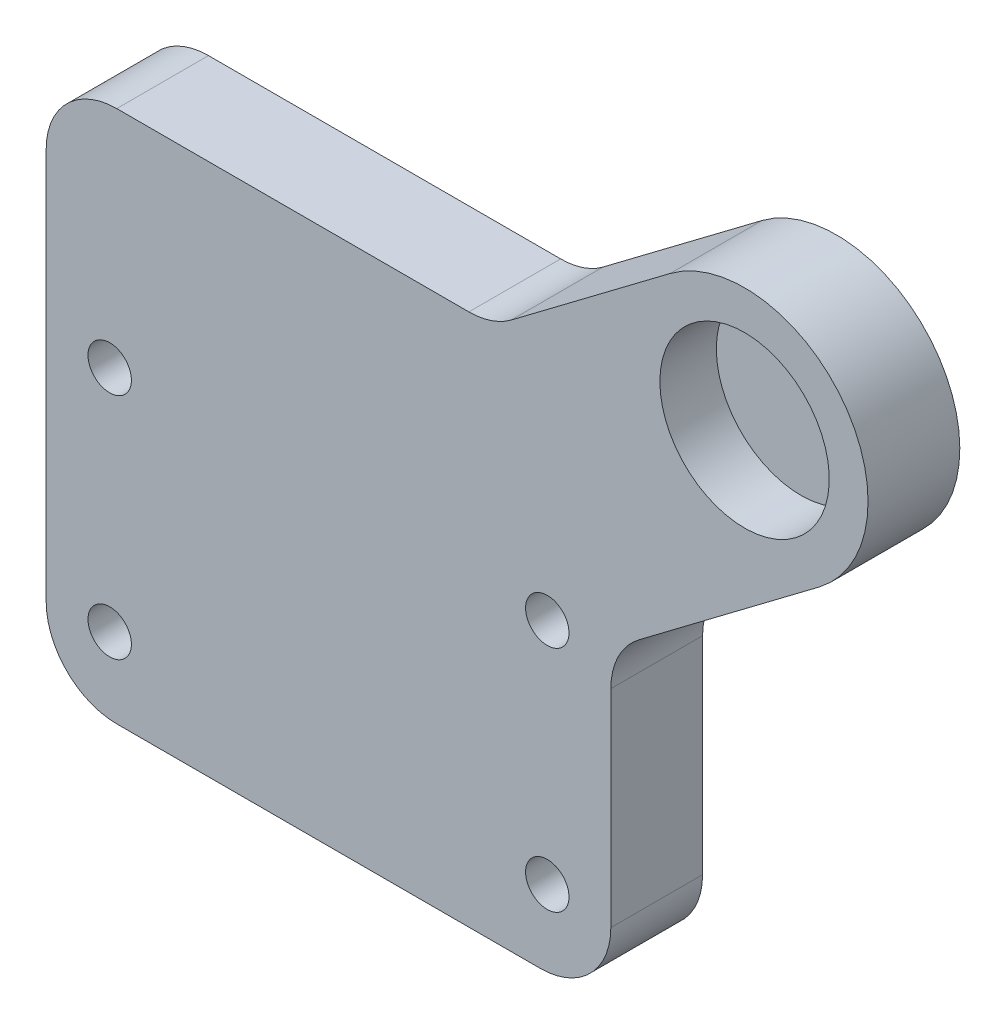
ISO-10303-21;
HEADER;
FILE_DESCRIPTION(('STEP AP214'),'2;1');
FILE_NAME('part.step','',(''),(''),'','','');
FILE_SCHEMA(('AUTOMOTIVE_DESIGN { 1 0 10303 214 1 1 1 1 }'));
ENDSEC;
DATA;
#1=APPLICATION_CONTEXT('core data for automotive mechanical design processes');
#2=APPLICATION_PROTOCOL_DEFINITION('international standard','automotive_design',2000,#1);
#3=PRODUCT_CONTEXT('',#1,'mechanical');
#4=PRODUCT('Part','Part','',(#3));
#5=PRODUCT_RELATED_PRODUCT_CATEGORY('part','',(#4));
#6=PRODUCT_DEFINITION_FORMATION('','',#4);
#7=PRODUCT_DEFINITION_CONTEXT('part definition',#1,'design');
#8=PRODUCT_DEFINITION('design','',#6,#7);
#9=PRODUCT_DEFINITION_SHAPE('','',#8);
#10=(LENGTH_UNIT() NAMED_UNIT(*) SI_UNIT(.MILLI.,.METRE.));
#11=(NAMED_UNIT(*) PLANE_ANGLE_UNIT() SI_UNIT($,.RADIAN.));
#12=(NAMED_UNIT(*) SI_UNIT($,.STERADIAN.) SOLID_ANGLE_UNIT());
#13=UNCERTAINTY_MEASURE_WITH_UNIT(LENGTH_MEASURE(1.E-05),#10,'distance_accuracy_value','');
#14=(GEOMETRIC_REPRESENTATION_CONTEXT(3) GLOBAL_UNCERTAINTY_ASSIGNED_CONTEXT((#13)) GLOBAL_UNIT_ASSIGNED_CONTEXT((#10,
#11,#12)) REPRESENTATION_CONTEXT('',''));
#15=CARTESIAN_POINT('',(0.,0.,0.));
#16=DIRECTION('',(0.,0.,1.));
#17=DIRECTION('',(1.,0.,0.));
#18=AXIS2_PLACEMENT_3D('',#15,#16,#17);
#19=CARTESIAN_POINT('',(58.9473260814253,242.5,18.));
#20=DIRECTION('',(0.,0.,1.));
#21=DIRECTION('',(1.,0.,0.));
#22=AXIS2_PLACEMENT_3D('',#19,#20,#21);
#23=PLANE('',#22);
#24=CARTESIAN_POINT('',(58.9473260814253,242.5,18.));
#25=DIRECTION('',(0.,0.,-1.));
#26=DIRECTION('',(-1.,0.,0.));
#27=AXIS2_PLACEMENT_3D('',#24,#25,#26);
#28=CIRCLE('',#27,12.);
#29=CARTESIAN_POINT('',(46.9473260814253,242.5,18.));
#30=VERTEX_POINT('',#29);
#31=EDGE_CURVE('E19',#30,#30,#28,.F.);
#32=ORIENTED_EDGE('',*,*,#31,.T.);
#33=EDGE_LOOP('',(#32));
#34=FACE_BOUND('',#33,.T.);
#35=ADVANCED_FACE('F16',(#34),#23,.T.);
#36=CARTESIAN_POINT('',(58.9473260814253,242.5,26.));
#37=DIRECTION('',(0.,0.,-1.));
#38=DIRECTION('',(-1.,0.,0.));
#39=AXIS2_PLACEMENT_3D('',#36,#37,#38);
#40=CYLINDRICAL_SURFACE('',#39,12.);
#41=ORIENTED_EDGE('',*,*,#31,.F.);
#42=EDGE_LOOP('',(#41));
#43=FACE_BOUND('',#42,.T.);
#44=CARTESIAN_POINT('',(58.9473260814253,242.5,26.));
#45=DIRECTION('',(0.,0.,-1.));
#46=DIRECTION('',(-1.,0.,0.));
#47=AXIS2_PLACEMENT_3D('',#44,#45,#46);
#48=CIRCLE('',#47,12.);
#49=CARTESIAN_POINT('',(46.9473260814253,242.5,26.));
#50=VERTEX_POINT('',#49);
#51=EDGE_CURVE('E122',#50,#50,#48,.T.);
#52=ORIENTED_EDGE('',*,*,#51,.F.);
#53=EDGE_LOOP('',(#52));
#54=FACE_BOUND('',#53,.T.);
#55=ADVANCED_FACE('F208',(#43,#54),#40,.F.);
#56=CARTESIAN_POINT('',(18.2236630407125,211.,26.));
#57=DIRECTION('',(0.,0.,1.));
#58=DIRECTION('',(1.,0.,0.));
#59=AXIS2_PLACEMENT_3D('',#56,#57,#58);
#60=PLANE('',#59);
#61=CARTESIAN_POINT('',(30.9999999999998,205.2,26.));
#62=DIRECTION('',(0.,0.,-1.));
#63=DIRECTION('',(-1.,0.,0.));
#64=AXIS2_PLACEMENT_3D('',#61,#62,#63);
#65=CIRCLE('',#64,3.075);
#66=CARTESIAN_POINT('',(27.9249999999998,205.2,26.));
#67=VERTEX_POINT('',#66);
#68=EDGE_CURVE('E180',#67,#67,#65,.T.);
#69=ORIENTED_EDGE('',*,*,#68,.T.);
#70=EDGE_LOOP('',(#69));
#71=FACE_BOUND('',#70,.T.);
#72=CARTESIAN_POINT('',(-31.0000000000001,172.8,26.));
#73=DIRECTION('',(0.,0.,-1.));
#74=DIRECTION('',(-1.,0.,0.));
#75=AXIS2_PLACEMENT_3D('',#72,#73,#74);
#76=CIRCLE('',#75,3.075);
#77=CARTESIAN_POINT('',(-34.0750000000001,172.8,26.));
#78=VERTEX_POINT('',#77);
#79=EDGE_CURVE('E183',#78,#78,#76,.T.);
#80=ORIENTED_EDGE('',*,*,#79,.T.);
#81=EDGE_LOOP('',(#80));
#82=FACE_BOUND('',#81,.T.);
#83=CARTESIAN_POINT('',(-31.0000000000002,205.2,26.));
#84=DIRECTION('',(0.,0.,-1.));
#85=DIRECTION('',(-1.,0.,0.));
#86=AXIS2_PLACEMENT_3D('',#83,#84,#85);
#87=CIRCLE('',#86,3.075);
#88=CARTESIAN_POINT('',(-34.0750000000002,205.2,26.));
#89=VERTEX_POINT('',#88);
#90=EDGE_CURVE('E186',#89,#89,#87,.T.);
#91=ORIENTED_EDGE('',*,*,#90,.T.);
#92=EDGE_LOOP('',(#91));
#93=FACE_BOUND('',#92,.T.);
#94=CARTESIAN_POINT('',(30.9999999999999,172.8,26.));
#95=DIRECTION('',(0.,0.,-1.));
#96=DIRECTION('',(-1.,0.,0.));
#97=AXIS2_PLACEMENT_3D('',#94,#95,#96);
#98=CIRCLE('',#97,3.075);
#99=CARTESIAN_POINT('',(27.9249999999999,172.8,26.));
#100=VERTEX_POINT('',#99);
#101=EDGE_CURVE('E189',#100,#100,#98,.T.);
#102=ORIENTED_EDGE('',*,*,#101,.T.);
#103=EDGE_LOOP('',(#102));
#104=FACE_BOUND('',#103,.T.);
#105=ORIENTED_EDGE('',*,*,#51,.T.);
#106=EDGE_LOOP('',(#105));
#107=FACE_BOUND('',#106,.T.);
#108=DIRECTION('',(-0.798635510047293,-0.601815023152049,0.));
#109=VECTOR('',#108,1.);
#110=CARTESIAN_POINT('',(48.4155631762645,256.476121425828,26.));
#111=LINE('',#110,#109);
#112=CARTESIAN_POINT('',(25.9055965401796,239.513644899527,26.));
#113=VERTEX_POINT('',#112);
#114=CARTESIAN_POINT('',(48.4155631762644,256.476121425828,26.));
#115=VERTEX_POINT('',#114);
#116=EDGE_CURVE('E135',#113,#115,#111,.F.);
#117=ORIENTED_EDGE('',*,*,#116,.F.);
#118=CARTESIAN_POINT('',(19.8874463086592,247.5,26.));
#119=DIRECTION('',(0.,0.,1.));
#120=DIRECTION('',(1.,0.,0.));
#121=AXIS2_PLACEMENT_3D('',#118,#119,#120);
#122=CIRCLE('',#121,10.0000000000002);
#123=CARTESIAN_POINT('',(19.8874463086592,237.5,26.));
#124=VERTEX_POINT('',#123);
#125=EDGE_CURVE('E192',#113,#124,#122,.F.);
#126=ORIENTED_EDGE('',*,*,#125,.T.);
#127=DIRECTION('',(1.,0.,0.));
#128=VECTOR('',#127,1.);
#129=CARTESIAN_POINT('',(19.8874463086592,237.5,26.));
#130=LINE('',#129,#128);
#131=CARTESIAN_POINT('',(-30.0000000000002,237.5,26.));
#132=VERTEX_POINT('',#131);
#133=EDGE_CURVE('E118',#132,#124,#130,.T.);
#134=ORIENTED_EDGE('',*,*,#133,.F.);
#135=CARTESIAN_POINT('',(-30.0000000000002,227.5,26.));
#136=DIRECTION('',(0.,0.,1.));
#137=DIRECTION('',(1.,0.,0.));
#138=AXIS2_PLACEMENT_3D('',#135,#136,#137);
#139=CIRCLE('',#138,10.);
#140=CARTESIAN_POINT('',(-40.0000000000002,227.5,26.));
#141=VERTEX_POINT('',#140);
#142=EDGE_CURVE('E112',#141,#132,#139,.F.);
#143=ORIENTED_EDGE('',*,*,#142,.F.);
#144=DIRECTION('',(0.,1.,0.));
#145=VECTOR('',#144,1.);
#146=CARTESIAN_POINT('',(-40.0000000000002,227.5,26.));
#147=LINE('',#146,#145);
#148=CARTESIAN_POINT('',(-40.0000000000002,172.,26.));
#149=VERTEX_POINT('',#148);
#150=EDGE_CURVE('E102',#149,#141,#147,.T.);
#151=ORIENTED_EDGE('',*,*,#150,.F.);
#152=CARTESIAN_POINT('',(-30.0000000000002,172.,26.));
#153=DIRECTION('',(0.,0.,1.));
#154=DIRECTION('',(1.,0.,0.));
#155=AXIS2_PLACEMENT_3D('',#152,#153,#154);
#156=CIRCLE('',#155,10.);
#157=CARTESIAN_POINT('',(-30.0000000000002,162.,26.));
#158=VERTEX_POINT('',#157);
#159=EDGE_CURVE('E127',#158,#149,#156,.F.);
#160=ORIENTED_EDGE('',*,*,#159,.F.);
#161=DIRECTION('',(1.,0.,0.));
#162=VECTOR('',#161,1.);
#163=CARTESIAN_POINT('',(-30.0000000000002,162.,26.));
#164=LINE('',#163,#162);
#165=CARTESIAN_POINT('',(30.0000000000002,162.,26.));
#166=VERTEX_POINT('',#165);
#167=EDGE_CURVE('E147',#166,#158,#164,.F.);
#168=ORIENTED_EDGE('',*,*,#167,.F.);
#169=CARTESIAN_POINT('',(30.0000000000002,172.,26.));
#170=DIRECTION('',(0.,0.,1.));
#171=DIRECTION('',(1.,0.,0.));
#172=AXIS2_PLACEMENT_3D('',#169,#170,#171);
#173=CIRCLE('',#172,10.);
#174=CARTESIAN_POINT('',(40.0000000000002,172.,26.));
#175=VERTEX_POINT('',#174);
#176=EDGE_CURVE('E200',#175,#166,#173,.F.);
#177=ORIENTED_EDGE('',*,*,#176,.F.);
#178=DIRECTION('',(0.,1.,0.));
#179=VECTOR('',#178,1.);
#180=CARTESIAN_POINT('',(40.0000000000002,172.,26.));
#181=LINE('',#180,#179);
#182=CARTESIAN_POINT('',(40.0000000000002,201.323975594456,26.));
#183=VERTEX_POINT('',#182);
#184=EDGE_CURVE('E143',#183,#175,#181,.F.);
#185=ORIENTED_EDGE('',*,*,#184,.F.);
#186=CARTESIAN_POINT('',(50.0000000000002,201.323975594456,26.));
#187=DIRECTION('',(0.,0.,1.));
#188=DIRECTION('',(1.,0.,0.));
#189=AXIS2_PLACEMENT_3D('',#186,#187,#188);
#190=CIRCLE('',#189,9.99999999999997);
#191=CARTESIAN_POINT('',(43.9818497684799,209.310330694928,26.));
#192=VERTEX_POINT('',#191);
#193=EDGE_CURVE('E142',#183,#192,#190,.F.);
#194=ORIENTED_EDGE('',*,*,#193,.T.);
#195=DIRECTION('',(0.798635510047291,0.60181502315205,0.));
#196=VECTOR('',#195,1.);
#197=CARTESIAN_POINT('',(43.9818497684797,209.310330694928,26.));
#198=LINE('',#197,#196);
#199=CARTESIAN_POINT('',(69.4790889865861,228.523878574172,26.));
#200=VERTEX_POINT('',#199);
#201=EDGE_CURVE('E139',#200,#192,#198,.F.);
#202=ORIENTED_EDGE('',*,*,#201,.F.);
#203=CARTESIAN_POINT('',(58.9473260814253,242.5,26.));
#204=DIRECTION('',(0.,0.,1.));
#205=DIRECTION('',(1.,0.,0.));
#206=AXIS2_PLACEMENT_3D('',#203,#204,#205);
#207=CIRCLE('',#206,17.4999999999999);
#208=EDGE_CURVE('E195',#115,#200,#207,.F.);
#209=ORIENTED_EDGE('',*,*,#208,.F.);
#210=EDGE_LOOP('',(#117,#126,#134,#143,#151,#160,#168,#177,#185,#194,#202,#209));
#211=FACE_BOUND('',#210,.T.);
#212=ADVANCED_FACE('F116',(#71,#82,#93,#104,#107,#211),#60,.T.);
#213=CARTESIAN_POINT('',(-30.0000000000002,227.5,13.));
#214=DIRECTION('',(0.,0.,1.));
#215=DIRECTION('',(1.,0.,0.));
#216=AXIS2_PLACEMENT_3D('',#213,#214,#215);
#217=CYLINDRICAL_SURFACE('',#216,10.);
#218=ORIENTED_EDGE('',*,*,#142,.T.);
#219=DIRECTION('',(0.,0.,1.));
#220=VECTOR('',#219,1.);
#221=CARTESIAN_POINT('',(-30.0000000000002,237.5,13.));
#222=LINE('',#221,#220);
#223=CARTESIAN_POINT('',(-30.0000000000002,237.5,13.));
#224=VERTEX_POINT('',#223);
#225=EDGE_CURVE('E134',#224,#132,#222,.T.);
#226=ORIENTED_EDGE('',*,*,#225,.F.);
#227=CARTESIAN_POINT('',(-30.0000000000002,227.5,13.));
#228=DIRECTION('',(0.,0.,1.));
#229=DIRECTION('',(1.,0.,0.));
#230=AXIS2_PLACEMENT_3D('',#227,#228,#229);
#231=CIRCLE('',#230,10.);
#232=CARTESIAN_POINT('',(-40.0000000000002,227.5,13.));
#233=VERTEX_POINT('',#232);
#234=EDGE_CURVE('E126',#224,#233,#231,.T.);
#235=ORIENTED_EDGE('',*,*,#234,.T.);
#236=DIRECTION('',(0.,0.,1.));
#237=VECTOR('',#236,1.);
#238=CARTESIAN_POINT('',(-40.0000000000002,227.5,13.));
#239=LINE('',#238,#237);
#240=EDGE_CURVE('E107',#141,#233,#239,.F.);
#241=ORIENTED_EDGE('',*,*,#240,.F.);
#242=EDGE_LOOP('',(#218,#226,#235,#241));
#243=FACE_BOUND('',#242,.T.);
#244=ADVANCED_FACE('F125',(#243),#217,.T.);
#245=CARTESIAN_POINT('',(-40.0000000000002,227.5,13.));
#246=DIRECTION('',(-1.,0.,0.));
#247=DIRECTION('',(0.,0.,1.));
#248=AXIS2_PLACEMENT_3D('',#245,#246,#247);
#249=PLANE('',#248);
#250=ORIENTED_EDGE('',*,*,#150,.T.);
#251=ORIENTED_EDGE('',*,*,#240,.T.);
#252=DIRECTION('',(0.,1.,0.));
#253=VECTOR('',#252,1.);
#254=CARTESIAN_POINT('',(-40.0000000000002,211.,13.));
#255=LINE('',#254,#253);
#256=CARTESIAN_POINT('',(-40.0000000000002,172.,13.));
#257=VERTEX_POINT('',#256);
#258=EDGE_CURVE('E178',#233,#257,#255,.F.);
#259=ORIENTED_EDGE('',*,*,#258,.T.);
#260=DIRECTION('',(0.,0.,1.));
#261=VECTOR('',#260,1.);
#262=CARTESIAN_POINT('',(-40.0000000000002,172.,13.));
#263=LINE('',#262,#261);
#264=EDGE_CURVE('E109',#149,#257,#263,.F.);
#265=ORIENTED_EDGE('',*,*,#264,.F.);
#266=EDGE_LOOP('',(#250,#251,#259,#265));
#267=FACE_BOUND('',#266,.T.);
#268=ADVANCED_FACE('F104',(#267),#249,.T.);
#269=CARTESIAN_POINT('',(-30.0000000000002,172.,13.));
#270=DIRECTION('',(0.,0.,1.));
#271=DIRECTION('',(1.,0.,0.));
#272=AXIS2_PLACEMENT_3D('',#269,#270,#271);
#273=CYLINDRICAL_SURFACE('',#272,10.);
#274=ORIENTED_EDGE('',*,*,#159,.T.);
#275=ORIENTED_EDGE('',*,*,#264,.T.);
#276=CARTESIAN_POINT('',(-30.0000000000002,172.,13.));
#277=DIRECTION('',(0.,0.,1.));
#278=DIRECTION('',(1.,0.,0.));
#279=AXIS2_PLACEMENT_3D('',#276,#277,#278);
#280=CIRCLE('',#279,10.);
#281=CARTESIAN_POINT('',(-30.0000000000002,162.,13.));
#282=VERTEX_POINT('',#281);
#283=EDGE_CURVE('E175',#257,#282,#280,.T.);
#284=ORIENTED_EDGE('',*,*,#283,.T.);
#285=DIRECTION('',(0.,0.,-1.));
#286=VECTOR('',#285,1.);
#287=CARTESIAN_POINT('',(-30.0000000000002,162.,13.));
#288=LINE('',#287,#286);
#289=EDGE_CURVE('E148',#158,#282,#288,.T.);
#290=ORIENTED_EDGE('',*,*,#289,.F.);
#291=EDGE_LOOP('',(#274,#275,#284,#290));
#292=FACE_BOUND('',#291,.T.);
#293=ADVANCED_FACE('F277',(#292),#273,.T.);
#294=CARTESIAN_POINT('',(-30.0000000000002,162.,13.));
#295=DIRECTION('',(0.,-1.,0.));
#296=DIRECTION('',(0.,0.,-1.));
#297=AXIS2_PLACEMENT_3D('',#294,#295,#296);
#298=PLANE('',#297);
#299=ORIENTED_EDGE('',*,*,#167,.T.);
#300=ORIENTED_EDGE('',*,*,#289,.T.);
#301=DIRECTION('',(1.,0.,0.));
#302=VECTOR('',#301,1.);
#303=CARTESIAN_POINT('',(18.2236630407125,162.,13.));
#304=LINE('',#303,#302);
#305=CARTESIAN_POINT('',(30.0000000000002,162.,13.));
#306=VERTEX_POINT('',#305);
#307=EDGE_CURVE('E174',#282,#306,#304,.T.);
#308=ORIENTED_EDGE('',*,*,#307,.T.);
#309=DIRECTION('',(0.,0.,1.));
#310=VECTOR('',#309,1.);
#311=CARTESIAN_POINT('',(30.0000000000002,162.,13.));
#312=LINE('',#311,#310);
#313=EDGE_CURVE('E146',#166,#306,#312,.F.);
#314=ORIENTED_EDGE('',*,*,#313,.F.);
#315=EDGE_LOOP('',(#299,#300,#308,#314));
#316=FACE_BOUND('',#315,.T.);
#317=ADVANCED_FACE('F273',(#316),#298,.T.);
#318=CARTESIAN_POINT('',(30.0000000000002,172.,13.));
#319=DIRECTION('',(0.,0.,1.));
#320=DIRECTION('',(1.,0.,0.));
#321=AXIS2_PLACEMENT_3D('',#318,#319,#320);
#322=CYLINDRICAL_SURFACE('',#321,10.);
#323=ORIENTED_EDGE('',*,*,#176,.T.);
#324=ORIENTED_EDGE('',*,*,#313,.T.);
#325=CARTESIAN_POINT('',(30.0000000000002,172.,13.));
#326=DIRECTION('',(0.,0.,1.));
#327=DIRECTION('',(1.,0.,0.));
#328=AXIS2_PLACEMENT_3D('',#325,#326,#327);
#329=CIRCLE('',#328,10.);
#330=CARTESIAN_POINT('',(40.0000000000002,172.,13.));
#331=VERTEX_POINT('',#330);
#332=EDGE_CURVE('E171',#306,#331,#329,.T.);
#333=ORIENTED_EDGE('',*,*,#332,.T.);
#334=DIRECTION('',(0.,0.,-1.));
#335=VECTOR('',#334,1.);
#336=CARTESIAN_POINT('',(40.0000000000002,172.,13.));
#337=LINE('',#336,#335);
#338=EDGE_CURVE('E145',#175,#331,#337,.T.);
#339=ORIENTED_EDGE('',*,*,#338,.F.);
#340=EDGE_LOOP('',(#323,#324,#333,#339));
#341=FACE_BOUND('',#340,.T.);
#342=ADVANCED_FACE('F269',(#341),#322,.T.);
#343=CARTESIAN_POINT('',(40.0000000000002,172.,13.));
#344=DIRECTION('',(1.,0.,0.));
#345=DIRECTION('',(0.,0.,-1.));
#346=AXIS2_PLACEMENT_3D('',#343,#344,#345);
#347=PLANE('',#346);
#348=ORIENTED_EDGE('',*,*,#184,.T.);
#349=ORIENTED_EDGE('',*,*,#338,.T.);
#350=DIRECTION('',(0.,1.,0.));
#351=VECTOR('',#350,1.);
#352=CARTESIAN_POINT('',(40.0000000000002,211.,13.));
#353=LINE('',#352,#351);
#354=CARTESIAN_POINT('',(40.0000000000002,201.323975594456,13.));
#355=VERTEX_POINT('',#354);
#356=EDGE_CURVE('E170',#331,#355,#353,.T.);
#357=ORIENTED_EDGE('',*,*,#356,.T.);
#358=DIRECTION('',(0.,0.,1.));
#359=VECTOR('',#358,1.);
#360=CARTESIAN_POINT('',(40.0000000000002,201.323975594456,13.));
#361=LINE('',#360,#359);
#362=EDGE_CURVE('E199',#355,#183,#361,.T.);
#363=ORIENTED_EDGE('',*,*,#362,.T.);
#364=EDGE_LOOP('',(#348,#349,#357,#363));
#365=FACE_BOUND('',#364,.T.);
#366=ADVANCED_FACE('F265',(#365),#347,.T.);
#367=CARTESIAN_POINT('',(50.0000000000002,201.323975594456,13.));
#368=DIRECTION('',(0.,0.,1.));
#369=DIRECTION('',(1.,0.,0.));
#370=AXIS2_PLACEMENT_3D('',#367,#368,#369);
#371=CYLINDRICAL_SURFACE('',#370,9.99999999999997);
#372=DIRECTION('',(0.,0.,1.));
#373=VECTOR('',#372,1.);
#374=CARTESIAN_POINT('',(43.9818497684797,209.310330694928,13.));
#375=LINE('',#374,#373);
#376=CARTESIAN_POINT('',(43.9818497684799,209.310330694928,13.));
#377=VERTEX_POINT('',#376);
#378=EDGE_CURVE('E141',#192,#377,#375,.F.);
#379=ORIENTED_EDGE('',*,*,#378,.F.);
#380=ORIENTED_EDGE('',*,*,#193,.F.);
#381=ORIENTED_EDGE('',*,*,#362,.F.);
#382=CARTESIAN_POINT('',(50.0000000000002,201.323975594456,13.));
#383=DIRECTION('',(0.,0.,1.));
#384=DIRECTION('',(1.,0.,0.));
#385=AXIS2_PLACEMENT_3D('',#382,#383,#384);
#386=CIRCLE('',#385,9.99999999999997);
#387=EDGE_CURVE('E167',#355,#377,#386,.F.);
#388=ORIENTED_EDGE('',*,*,#387,.T.);
#389=EDGE_LOOP('',(#379,#380,#381,#388));
#390=FACE_BOUND('',#389,.T.);
#391=ADVANCED_FACE('F261',(#390),#371,.F.);
#392=CARTESIAN_POINT('',(43.9818497684797,209.310330694928,13.));
#393=DIRECTION('',(0.60181502315205,-0.798635510047291,0.));
#394=DIRECTION('',(0.798635510047291,0.60181502315205,0.));
#395=AXIS2_PLACEMENT_3D('',#392,#393,#394);
#396=PLANE('',#395);
#397=ORIENTED_EDGE('',*,*,#201,.T.);
#398=ORIENTED_EDGE('',*,*,#378,.T.);
#399=DIRECTION('',(0.798635510047291,0.60181502315205,0.));
#400=VECTOR('',#399,1.);
#401=CARTESIAN_POINT('',(43.9818497684797,209.310330694928,13.));
#402=LINE('',#401,#400);
#403=CARTESIAN_POINT('',(69.4790889865861,228.523878574172,13.));
#404=VERTEX_POINT('',#403);
#405=EDGE_CURVE('E166',#377,#404,#402,.T.);
#406=ORIENTED_EDGE('',*,*,#405,.T.);
#407=DIRECTION('',(0.,0.,1.));
#408=VECTOR('',#407,1.);
#409=CARTESIAN_POINT('',(69.4790889865859,228.523878574172,13.));
#410=LINE('',#409,#408);
#411=EDGE_CURVE('E138',#200,#404,#410,.F.);
#412=ORIENTED_EDGE('',*,*,#411,.F.);
#413=EDGE_LOOP('',(#397,#398,#406,#412));
#414=FACE_BOUND('',#413,.T.);
#415=ADVANCED_FACE('F257',(#414),#396,.T.);
#416=CARTESIAN_POINT('',(58.9473260814253,242.5,13.));
#417=DIRECTION('',(0.,0.,1.));
#418=DIRECTION('',(1.,0.,0.));
#419=AXIS2_PLACEMENT_3D('',#416,#417,#418);
#420=CYLINDRICAL_SURFACE('',#419,17.4999999999999);
#421=ORIENTED_EDGE('',*,*,#208,.T.);
#422=ORIENTED_EDGE('',*,*,#411,.T.);
#423=CARTESIAN_POINT('',(58.9473260814253,242.5,13.));
#424=DIRECTION('',(0.,0.,1.));
#425=DIRECTION('',(1.,0.,0.));
#426=AXIS2_PLACEMENT_3D('',#423,#424,#425);
#427=CIRCLE('',#426,17.4999999999999);
#428=CARTESIAN_POINT('',(48.4155631762643,256.476121425828,13.));
#429=VERTEX_POINT('',#428);
#430=EDGE_CURVE('E163',#404,#429,#427,.T.);
#431=ORIENTED_EDGE('',*,*,#430,.T.);
#432=DIRECTION('',(0.,0.,1.));
#433=VECTOR('',#432,1.);
#434=CARTESIAN_POINT('',(48.4155631762645,256.476121425828,13.));
#435=LINE('',#434,#433);
#436=EDGE_CURVE('E137',#115,#429,#435,.F.);
#437=ORIENTED_EDGE('',*,*,#436,.F.);
#438=EDGE_LOOP('',(#421,#422,#431,#437));
#439=FACE_BOUND('',#438,.T.);
#440=ADVANCED_FACE('F253',(#439),#420,.T.);
#441=CARTESIAN_POINT('',(48.4155631762645,256.476121425828,13.));
#442=DIRECTION('',(-0.601815023152049,0.798635510047293,0.));
#443=DIRECTION('',(-0.798635510047293,-0.601815023152049,0.));
#444=AXIS2_PLACEMENT_3D('',#441,#442,#443);
#445=PLANE('',#444);
#446=ORIENTED_EDGE('',*,*,#116,.T.);
#447=ORIENTED_EDGE('',*,*,#436,.T.);
#448=DIRECTION('',(-0.798635510047283,-0.601815023152061,0.));
#449=VECTOR('',#448,1.);
#450=CARTESIAN_POINT('',(48.4155631762645,256.476121425828,13.));
#451=LINE('',#450,#449);
#452=CARTESIAN_POINT('',(25.9055965401798,239.513644899527,13.));
#453=VERTEX_POINT('',#452);
#454=EDGE_CURVE('E162',#429,#453,#451,.T.);
#455=ORIENTED_EDGE('',*,*,#454,.T.);
#456=DIRECTION('',(0.,0.,1.));
#457=VECTOR('',#456,1.);
#458=CARTESIAN_POINT('',(25.9055965401798,239.513644899527,13.));
#459=LINE('',#458,#457);
#460=EDGE_CURVE('E194',#453,#113,#459,.T.);
#461=ORIENTED_EDGE('',*,*,#460,.T.);
#462=EDGE_LOOP('',(#446,#447,#455,#461));
#463=FACE_BOUND('',#462,.T.);
#464=ADVANCED_FACE('F249',(#463),#445,.T.);
#465=CARTESIAN_POINT('',(19.8874463086592,247.5,13.));
#466=DIRECTION('',(0.,0.,1.));
#467=DIRECTION('',(1.,0.,0.));
#468=AXIS2_PLACEMENT_3D('',#465,#466,#467);
#469=CYLINDRICAL_SURFACE('',#468,10.0000000000002);
#470=DIRECTION('',(0.,0.,1.));
#471=VECTOR('',#470,1.);
#472=CARTESIAN_POINT('',(19.8874463086592,237.5,13.));
#473=LINE('',#472,#471);
#474=CARTESIAN_POINT('',(19.8874463086592,237.5,13.));
#475=VERTEX_POINT('',#474);
#476=EDGE_CURVE('E34',#124,#475,#473,.F.);
#477=ORIENTED_EDGE('',*,*,#476,.F.);
#478=ORIENTED_EDGE('',*,*,#125,.F.);
#479=ORIENTED_EDGE('',*,*,#460,.F.);
#480=CARTESIAN_POINT('',(19.8874463086592,247.5,13.));
#481=DIRECTION('',(0.,0.,1.));
#482=DIRECTION('',(1.,0.,0.));
#483=AXIS2_PLACEMENT_3D('',#480,#481,#482);
#484=CIRCLE('',#483,10.0000000000002);
#485=EDGE_CURVE('E159',#453,#475,#484,.F.);
#486=ORIENTED_EDGE('',*,*,#485,.T.);
#487=EDGE_LOOP('',(#477,#478,#479,#486));
#488=FACE_BOUND('',#487,.T.);
#489=ADVANCED_FACE('F246',(#488),#469,.F.);
#490=CARTESIAN_POINT('',(19.8874463086592,237.5,13.));
#491=DIRECTION('',(0.,1.,0.));
#492=DIRECTION('',(0.,0.,1.));
#493=AXIS2_PLACEMENT_3D('',#490,#491,#492);
#494=PLANE('',#493);
#495=ORIENTED_EDGE('',*,*,#133,.T.);
#496=ORIENTED_EDGE('',*,*,#476,.T.);
#497=DIRECTION('',(1.,0.,0.));
#498=VECTOR('',#497,1.);
#499=CARTESIAN_POINT('',(18.2236630407125,237.5,13.));
#500=LINE('',#499,#498);
#501=EDGE_CURVE('E158',#475,#224,#500,.F.);
#502=ORIENTED_EDGE('',*,*,#501,.T.);
#503=ORIENTED_EDGE('',*,*,#225,.T.);
#504=EDGE_LOOP('',(#495,#496,#502,#503));
#505=FACE_BOUND('',#504,.T.);
#506=ADVANCED_FACE('F242',(#505),#494,.T.);
#507=CARTESIAN_POINT('',(30.9999999999999,172.8,17.55));
#508=DIRECTION('',(0.,0.,-1.));
#509=DIRECTION('',(-1.,0.,0.));
#510=AXIS2_PLACEMENT_3D('',#507,#508,#509);
#511=CYLINDRICAL_SURFACE('',#510,3.075);
#512=CARTESIAN_POINT('',(30.9999999999999,172.8,13.));
#513=DIRECTION('',(0.,0.,-1.));
#514=DIRECTION('',(-1.,0.,0.));
#515=AXIS2_PLACEMENT_3D('',#512,#513,#514);
#516=CIRCLE('',#515,3.075);
#517=CARTESIAN_POINT('',(27.9249999999999,172.8,13.));
#518=VERTEX_POINT('',#517);
#519=EDGE_CURVE('E155',#518,#518,#516,.T.);
#520=ORIENTED_EDGE('',*,*,#519,.T.);
#521=EDGE_LOOP('',(#520));
#522=FACE_BOUND('',#521,.T.);
#523=ORIENTED_EDGE('',*,*,#101,.F.);
#524=EDGE_LOOP('',(#523));
#525=FACE_BOUND('',#524,.T.);
#526=ADVANCED_FACE('F238',(#522,#525),#511,.F.);
#527=CARTESIAN_POINT('',(-31.0000000000002,205.2,17.55));
#528=DIRECTION('',(0.,0.,-1.));
#529=DIRECTION('',(-1.,0.,0.));
#530=AXIS2_PLACEMENT_3D('',#527,#528,#529);
#531=CYLINDRICAL_SURFACE('',#530,3.075);
#532=CARTESIAN_POINT('',(-31.0000000000002,205.2,13.));
#533=DIRECTION('',(0.,0.,-1.));
#534=DIRECTION('',(-1.,0.,0.));
#535=AXIS2_PLACEMENT_3D('',#532,#533,#534);
#536=CIRCLE('',#535,3.075);
#537=CARTESIAN_POINT('',(-34.0750000000002,205.2,13.));
#538=VERTEX_POINT('',#537);
#539=EDGE_CURVE('E152',#538,#538,#536,.T.);
#540=ORIENTED_EDGE('',*,*,#539,.T.);
#541=EDGE_LOOP('',(#540));
#542=FACE_BOUND('',#541,.T.);
#543=ORIENTED_EDGE('',*,*,#90,.F.);
#544=EDGE_LOOP('',(#543));
#545=FACE_BOUND('',#544,.T.);
#546=ADVANCED_FACE('F234',(#542,#545),#531,.F.);
#547=CARTESIAN_POINT('',(-31.0000000000001,172.8,17.55));
#548=DIRECTION('',(0.,0.,-1.));
#549=DIRECTION('',(-1.,0.,0.));
#550=AXIS2_PLACEMENT_3D('',#547,#548,#549);
#551=CYLINDRICAL_SURFACE('',#550,3.075);
#552=CARTESIAN_POINT('',(-31.0000000000001,172.8,13.));
#553=DIRECTION('',(0.,0.,-1.));
#554=DIRECTION('',(-1.,0.,0.));
#555=AXIS2_PLACEMENT_3D('',#552,#553,#554);
#556=CIRCLE('',#555,3.075);
#557=CARTESIAN_POINT('',(-34.0750000000001,172.8,13.));
#558=VERTEX_POINT('',#557);
#559=EDGE_CURVE('E25',#558,#558,#556,.T.);
#560=ORIENTED_EDGE('',*,*,#559,.T.);
#561=EDGE_LOOP('',(#560));
#562=FACE_BOUND('',#561,.T.);
#563=ORIENTED_EDGE('',*,*,#79,.F.);
#564=EDGE_LOOP('',(#563));
#565=FACE_BOUND('',#564,.T.);
#566=ADVANCED_FACE('F226',(#562,#565),#551,.F.);
#567=CARTESIAN_POINT('',(30.9999999999998,205.2,17.55));
#568=DIRECTION('',(0.,0.,-1.));
#569=DIRECTION('',(-1.,0.,0.));
#570=AXIS2_PLACEMENT_3D('',#567,#568,#569);
#571=CYLINDRICAL_SURFACE('',#570,3.075);
#572=CARTESIAN_POINT('',(30.9999999999998,205.2,13.));
#573=DIRECTION('',(0.,0.,-1.));
#574=DIRECTION('',(-1.,0.,0.));
#575=AXIS2_PLACEMENT_3D('',#572,#573,#574);
#576=CIRCLE('',#575,3.075);
#577=CARTESIAN_POINT('',(27.9249999999998,205.2,13.));
#578=VERTEX_POINT('',#577);
#579=EDGE_CURVE('E11',#578,#578,#576,.T.);
#580=ORIENTED_EDGE('',*,*,#579,.T.);
#581=EDGE_LOOP('',(#580));
#582=FACE_BOUND('',#581,.T.);
#583=ORIENTED_EDGE('',*,*,#68,.F.);
#584=EDGE_LOOP('',(#583));
#585=FACE_BOUND('',#584,.T.);
#586=ADVANCED_FACE('F220',(#582,#585),#571,.F.);
#587=CARTESIAN_POINT('',(18.2236630407125,211.,13.));
#588=DIRECTION('',(0.,0.,1.));
#589=DIRECTION('',(1.,0.,0.));
#590=AXIS2_PLACEMENT_3D('',#587,#588,#589);
#591=PLANE('',#590);
#592=ORIENTED_EDGE('',*,*,#579,.F.);
#593=EDGE_LOOP('',(#592));
#594=FACE_BOUND('',#593,.T.);
#595=ORIENTED_EDGE('',*,*,#559,.F.);
#596=EDGE_LOOP('',(#595));
#597=FACE_BOUND('',#596,.T.);
#598=ORIENTED_EDGE('',*,*,#539,.F.);
#599=EDGE_LOOP('',(#598));
#600=FACE_BOUND('',#599,.T.);
#601=ORIENTED_EDGE('',*,*,#519,.F.);
#602=EDGE_LOOP('',(#601));
#603=FACE_BOUND('',#602,.T.);
#604=ORIENTED_EDGE('',*,*,#485,.F.);
#605=ORIENTED_EDGE('',*,*,#454,.F.);
#606=ORIENTED_EDGE('',*,*,#430,.F.);
#607=ORIENTED_EDGE('',*,*,#405,.F.);
#608=ORIENTED_EDGE('',*,*,#387,.F.);
#609=ORIENTED_EDGE('',*,*,#356,.F.);
#610=ORIENTED_EDGE('',*,*,#332,.F.);
#611=ORIENTED_EDGE('',*,*,#307,.F.);
#612=ORIENTED_EDGE('',*,*,#283,.F.);
#613=ORIENTED_EDGE('',*,*,#258,.F.);
#614=ORIENTED_EDGE('',*,*,#234,.F.);
#615=ORIENTED_EDGE('',*,*,#501,.F.);
#616=EDGE_LOOP('',(#604,#605,#606,#607,#608,#609,#610,#611,#612,#613,#614,#615));
#617=FACE_BOUND('',#616,.T.);
#618=ADVANCED_FACE('F218',(#594,#597,#600,#603,#617),#591,.F.);
#619=CLOSED_SHELL('',(#35,#55,#212,#244,#268,#293,#317,#342,#366,#391,#415,#440,#464,#489,#506,
#526,#546,#566,#586,#618));
#620=MANIFOLD_SOLID_BREP('B1',#619);
#621=ADVANCED_BREP_SHAPE_REPRESENTATION('',(#18,#620),#14);
#622=SHAPE_DEFINITION_REPRESENTATION(#9,#621);
ENDSEC;
END-ISO-10303-21;
